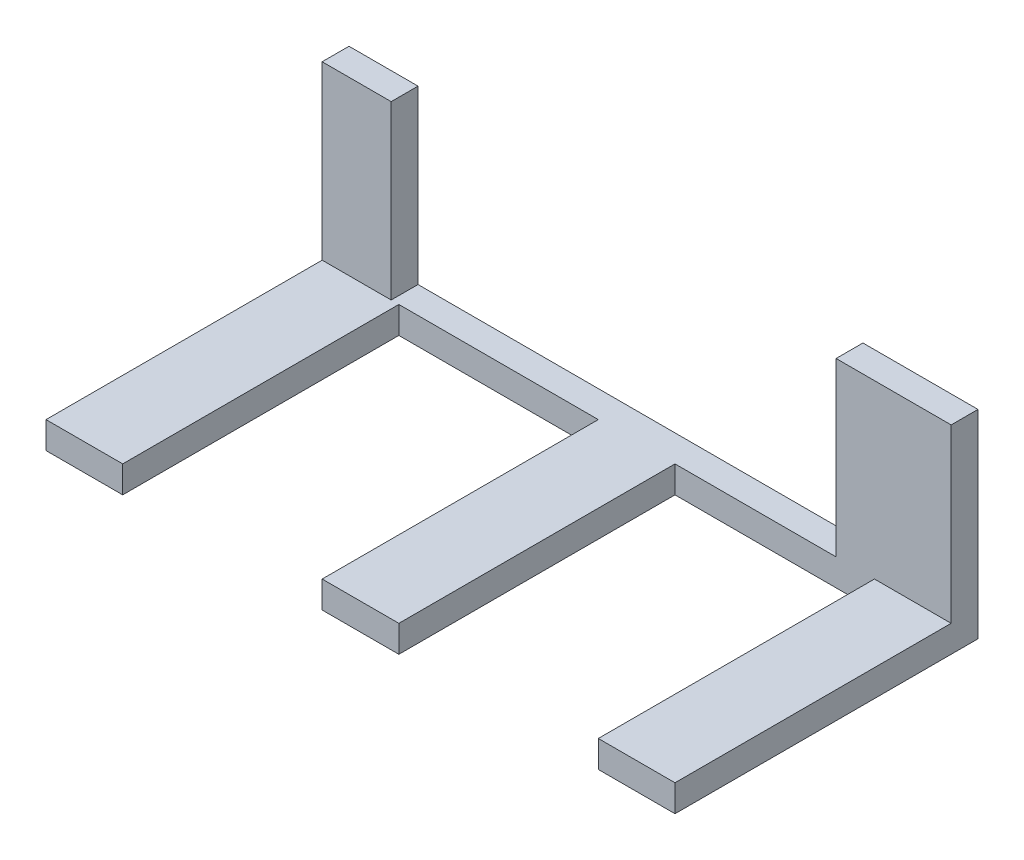
ISO-10303-21;
HEADER;
FILE_DESCRIPTION(('STEP AP214'),'2;1');
FILE_NAME('part.step','',(''),(''),'','','');
FILE_SCHEMA(('AUTOMOTIVE_DESIGN { 1 0 10303 214 1 1 1 1 }'));
ENDSEC;
DATA;
#1=APPLICATION_CONTEXT('core data for automotive mechanical design processes');
#2=APPLICATION_PROTOCOL_DEFINITION('international standard','automotive_design',2000,#1);
#3=PRODUCT_CONTEXT('',#1,'mechanical');
#4=PRODUCT('Part','Part','',(#3));
#5=PRODUCT_RELATED_PRODUCT_CATEGORY('part','',(#4));
#6=PRODUCT_DEFINITION_FORMATION('','',#4);
#7=PRODUCT_DEFINITION_CONTEXT('part definition',#1,'design');
#8=PRODUCT_DEFINITION('design','',#6,#7);
#9=PRODUCT_DEFINITION_SHAPE('','',#8);
#10=(LENGTH_UNIT() NAMED_UNIT(*) SI_UNIT(.MILLI.,.METRE.));
#11=(NAMED_UNIT(*) PLANE_ANGLE_UNIT() SI_UNIT($,.RADIAN.));
#12=(NAMED_UNIT(*) SI_UNIT($,.STERADIAN.) SOLID_ANGLE_UNIT());
#13=UNCERTAINTY_MEASURE_WITH_UNIT(LENGTH_MEASURE(1.E-05),#10,'distance_accuracy_value','');
#14=(GEOMETRIC_REPRESENTATION_CONTEXT(3) GLOBAL_UNCERTAINTY_ASSIGNED_CONTEXT((#13)) GLOBAL_UNIT_ASSIGNED_CONTEXT((#10,
#11,#12)) REPRESENTATION_CONTEXT('',''));
#15=CARTESIAN_POINT('',(0.,0.,0.));
#16=DIRECTION('',(0.,0.,1.));
#17=DIRECTION('',(1.,0.,0.));
#18=AXIS2_PLACEMENT_3D('',#15,#16,#17);
#19=CARTESIAN_POINT('',(0.,0.,3.5));
#20=DIRECTION('',(0.,0.,1.));
#21=DIRECTION('',(1.,0.,0.));
#22=AXIS2_PLACEMENT_3D('',#19,#20,#21);
#23=PLANE('',#22);
#24=DIRECTION('',(0.,-1.,0.));
#25=VECTOR('',#24,1.);
#26=CARTESIAN_POINT('',(13.2274700071922,0.,3.5));
#27=LINE('',#26,#25);
#28=CARTESIAN_POINT('',(13.2274700071922,-24.9519464720195,3.5));
#29=VERTEX_POINT('',#28);
#30=CARTESIAN_POINT('',(13.2274700071922,-28.4519464720195,3.5));
#31=VERTEX_POINT('',#30);
#32=EDGE_CURVE('E53',#29,#31,#27,.T.);
#33=ORIENTED_EDGE('',*,*,#32,.F.);
#34=DIRECTION('',(-1.,0.,0.));
#35=VECTOR('',#34,1.);
#36=CARTESIAN_POINT('',(0.,-24.9519464720195,3.5));
#37=LINE('',#36,#35);
#38=CARTESIAN_POINT('',(23.2274700071922,-24.9519464720195,3.5));
#39=VERTEX_POINT('',#38);
#40=EDGE_CURVE('E184',#39,#29,#37,.T.);
#41=ORIENTED_EDGE('',*,*,#40,.F.);
#42=DIRECTION('',(0.,1.,0.));
#43=VECTOR('',#42,1.);
#44=CARTESIAN_POINT('',(23.2274700071922,-28.4519464720195,3.5));
#45=LINE('',#44,#43);
#46=CARTESIAN_POINT('',(23.2274700071922,-2.55194647201947,3.5));
#47=VERTEX_POINT('',#46);
#48=EDGE_CURVE('E272',#39,#47,#45,.T.);
#49=ORIENTED_EDGE('',*,*,#48,.T.);
#50=DIRECTION('',(1.,0.,0.));
#51=VECTOR('',#50,1.);
#52=CARTESIAN_POINT('',(8.22747000719218,-2.55194647201947,3.5));
#53=LINE('',#52,#51);
#54=CARTESIAN_POINT('',(8.22747000719218,-2.55194647201947,3.5));
#55=VERTEX_POINT('',#54);
#56=EDGE_CURVE('E294',#55,#47,#53,.T.);
#57=ORIENTED_EDGE('',*,*,#56,.F.);
#58=DIRECTION('',(0.,-1.,0.));
#59=VECTOR('',#58,1.);
#60=CARTESIAN_POINT('',(8.22747000719218,-2.55194647201947,3.5));
#61=LINE('',#60,#59);
#62=CARTESIAN_POINT('',(8.22747000719218,-24.9519464720195,3.5));
#63=VERTEX_POINT('',#62);
#64=EDGE_CURVE('E290',#55,#63,#61,.T.);
#65=ORIENTED_EDGE('',*,*,#64,.T.);
#66=DIRECTION('',(-1.,0.,0.));
#67=VECTOR('',#66,1.);
#68=CARTESIAN_POINT('',(-58.7725299928078,-24.9519464720195,3.5));
#69=LINE('',#68,#67);
#70=CARTESIAN_POINT('',(-12.7725299928078,-24.9519464720195,3.5));
#71=VERTEX_POINT('',#70);
#72=EDGE_CURVE('E280',#63,#71,#69,.T.);
#73=ORIENTED_EDGE('',*,*,#72,.T.);
#74=DIRECTION('',(0.,-1.,0.));
#75=VECTOR('',#74,1.);
#76=CARTESIAN_POINT('',(-12.7725299928078,0.,3.5));
#77=LINE('',#76,#75);
#78=CARTESIAN_POINT('',(-12.7725299928078,-28.4519464720195,3.5));
#79=VERTEX_POINT('',#78);
#80=EDGE_CURVE('E188',#71,#79,#77,.T.);
#81=ORIENTED_EDGE('',*,*,#80,.T.);
#82=DIRECTION('',(1.,0.,0.));
#83=VECTOR('',#82,1.);
#84=CARTESIAN_POINT('',(-58.7725299928078,-28.4519464720195,3.5));
#85=LINE('',#84,#83);
#86=EDGE_CURVE('E58',#79,#31,#85,.T.);
#87=ORIENTED_EDGE('',*,*,#86,.T.);
#88=EDGE_LOOP('',(#33,#41,#49,#57,#65,#73,#81,#87));
#89=FACE_BOUND('',#88,.T.);
#90=ADVANCED_FACE('F35',(#89),#23,.T.);
#91=DIRECTION('',(0.,1.,0.));
#92=VECTOR('',#91,1.);
#93=CARTESIAN_POINT('',(-22.7725299928079,0.,3.5));
#94=LINE('',#93,#92);
#95=CARTESIAN_POINT('',(-22.7725299928078,-28.4519464720195,3.5));
#96=VERTEX_POINT('',#95);
#97=CARTESIAN_POINT('',(-22.7725299928078,-24.9519464720195,3.5));
#98=VERTEX_POINT('',#97);
#99=EDGE_CURVE('E185',#96,#98,#94,.T.);
#100=ORIENTED_EDGE('',*,*,#99,.T.);
#101=CARTESIAN_POINT('',(-48.7725299928078,-24.9519464720195,3.5));
#102=VERTEX_POINT('',#101);
#103=EDGE_CURVE('E39',#98,#102,#69,.T.);
#104=ORIENTED_EDGE('',*,*,#103,.T.);
#105=DIRECTION('',(0.,1.,0.));
#106=VECTOR('',#105,1.);
#107=CARTESIAN_POINT('',(-48.7725299928078,0.,3.5));
#108=LINE('',#107,#106);
#109=CARTESIAN_POINT('',(-48.7725299928078,-28.4519464720195,3.5));
#110=VERTEX_POINT('',#109);
#111=EDGE_CURVE('E217',#110,#102,#108,.T.);
#112=ORIENTED_EDGE('',*,*,#111,.F.);
#113=EDGE_CURVE('E235',#110,#96,#85,.T.);
#114=ORIENTED_EDGE('',*,*,#113,.T.);
#115=EDGE_LOOP('',(#100,#104,#112,#114));
#116=FACE_BOUND('',#115,.T.);
#117=ADVANCED_FACE('F371',(#116),#23,.T.);
#118=DIRECTION('',(-1.,0.,0.));
#119=VECTOR('',#118,1.);
#120=CARTESIAN_POINT('',(0.,-24.9519464720195,3.5));
#121=LINE('',#120,#119);
#122=CARTESIAN_POINT('',(-49.7725299928078,-24.9519464720195,3.5));
#123=VERTEX_POINT('',#122);
#124=CARTESIAN_POINT('',(-58.7725299928078,-24.9519464720195,3.5));
#125=VERTEX_POINT('',#124);
#126=EDGE_CURVE('E11',#123,#125,#121,.T.);
#127=ORIENTED_EDGE('',*,*,#126,.F.);
#128=DIRECTION('',(0.,-1.,0.));
#129=VECTOR('',#128,1.);
#130=CARTESIAN_POINT('',(-49.7725299928078,-2.55194647201947,3.5));
#131=LINE('',#130,#129);
#132=CARTESIAN_POINT('',(-49.7725299928078,-2.55194647201947,3.5));
#133=VERTEX_POINT('',#132);
#134=EDGE_CURVE('E260',#133,#123,#131,.T.);
#135=ORIENTED_EDGE('',*,*,#134,.F.);
#136=DIRECTION('',(1.,0.,0.));
#137=VECTOR('',#136,1.);
#138=CARTESIAN_POINT('',(-49.7725299928078,-2.55194647201947,3.5));
#139=LINE('',#138,#137);
#140=CARTESIAN_POINT('',(-58.7725299928078,-2.55194647201947,3.5));
#141=VERTEX_POINT('',#140);
#142=EDGE_CURVE('E310',#141,#133,#139,.T.);
#143=ORIENTED_EDGE('',*,*,#142,.F.);
#144=DIRECTION('',(0.,-1.,0.));
#145=VECTOR('',#144,1.);
#146=CARTESIAN_POINT('',(-58.7725299928078,-24.9519464720195,3.5));
#147=LINE('',#146,#145);
#148=EDGE_CURVE('E266',#141,#125,#147,.T.);
#149=ORIENTED_EDGE('',*,*,#148,.T.);
#150=EDGE_LOOP('',(#127,#135,#143,#149));
#151=FACE_BOUND('',#150,.T.);
#152=ADVANCED_FACE('F322',(#151),#23,.T.);
#153=CARTESIAN_POINT('',(-58.7725299928078,-24.9519464720195,3.5));
#154=DIRECTION('',(0.,-1.,0.));
#155=DIRECTION('',(0.,0.,-1.));
#156=AXIS2_PLACEMENT_3D('',#153,#154,#155);
#157=PLANE('',#156);
#158=DIRECTION('',(0.,0.,-1.));
#159=VECTOR('',#158,1.);
#160=CARTESIAN_POINT('',(-49.7725299928078,-24.9519464720195,0.));
#161=LINE('',#160,#159);
#162=CARTESIAN_POINT('',(-49.7725299928078,-24.9519464720195,0.));
#163=VERTEX_POINT('',#162);
#164=EDGE_CURVE('E252',#123,#163,#161,.T.);
#165=ORIENTED_EDGE('',*,*,#164,.F.);
#166=ORIENTED_EDGE('',*,*,#126,.T.);
#167=DIRECTION('',(0.,0.,-1.));
#168=VECTOR('',#167,1.);
#169=CARTESIAN_POINT('',(-58.7725299928078,-24.9519464720195,39.5));
#170=LINE('',#169,#168);
#171=CARTESIAN_POINT('',(-58.7725299928078,-24.9519464720195,39.5));
#172=VERTEX_POINT('',#171);
#173=EDGE_CURVE('E247',#172,#125,#170,.T.);
#174=ORIENTED_EDGE('',*,*,#173,.F.);
#175=DIRECTION('',(-1.,0.,0.));
#176=VECTOR('',#175,1.);
#177=CARTESIAN_POINT('',(0.,-24.9519464720195,39.5));
#178=LINE('',#177,#176);
#179=CARTESIAN_POINT('',(-48.7725299928078,-24.9519464720195,39.5));
#180=VERTEX_POINT('',#179);
#181=EDGE_CURVE('E218',#180,#172,#178,.T.);
#182=ORIENTED_EDGE('',*,*,#181,.F.);
#183=DIRECTION('',(0.,0.,-1.));
#184=VECTOR('',#183,1.);
#185=CARTESIAN_POINT('',(-48.7725299928078,-24.9519464720195,39.5));
#186=LINE('',#185,#184);
#187=EDGE_CURVE('E228',#180,#102,#186,.T.);
#188=ORIENTED_EDGE('',*,*,#187,.T.);
#189=ORIENTED_EDGE('',*,*,#103,.F.);
#190=DIRECTION('',(0.,0.,-1.));
#191=VECTOR('',#190,1.);
#192=CARTESIAN_POINT('',(-22.7725299928078,-24.9519464720195,39.5));
#193=LINE('',#192,#191);
#194=CARTESIAN_POINT('',(-22.7725299928078,-24.9519464720195,39.5));
#195=VERTEX_POINT('',#194);
#196=EDGE_CURVE('E203',#195,#98,#193,.T.);
#197=ORIENTED_EDGE('',*,*,#196,.F.);
#198=DIRECTION('',(-1.,0.,0.));
#199=VECTOR('',#198,1.);
#200=CARTESIAN_POINT('',(0.,-24.9519464720195,39.5));
#201=LINE('',#200,#199);
#202=CARTESIAN_POINT('',(-12.7725299928078,-24.9519464720195,39.5));
#203=VERTEX_POINT('',#202);
#204=EDGE_CURVE('E202',#203,#195,#201,.T.);
#205=ORIENTED_EDGE('',*,*,#204,.F.);
#206=DIRECTION('',(0.,0.,-1.));
#207=VECTOR('',#206,1.);
#208=CARTESIAN_POINT('',(-12.7725299928078,-24.9519464720195,39.5));
#209=LINE('',#208,#207);
#210=EDGE_CURVE('E208',#203,#71,#209,.T.);
#211=ORIENTED_EDGE('',*,*,#210,.T.);
#212=ORIENTED_EDGE('',*,*,#72,.F.);
#213=DIRECTION('',(0.,0.,1.));
#214=VECTOR('',#213,1.);
#215=CARTESIAN_POINT('',(8.22747000719218,-24.9519464720195,0.));
#216=LINE('',#215,#214);
#217=CARTESIAN_POINT('',(8.22747000719218,-24.9519464720195,0.));
#218=VERTEX_POINT('',#217);
#219=EDGE_CURVE('E263',#218,#63,#216,.T.);
#220=ORIENTED_EDGE('',*,*,#219,.F.);
#221=DIRECTION('',(-1.,0.,0.));
#222=VECTOR('',#221,1.);
#223=CARTESIAN_POINT('',(-58.7725299928078,-24.9519464720195,0.));
#224=LINE('',#223,#222);
#225=EDGE_CURVE('E284',#218,#163,#224,.T.);
#226=ORIENTED_EDGE('',*,*,#225,.T.);
#227=EDGE_LOOP('',(#165,#166,#174,#182,#188,#189,#197,#205,#211,#212,#220,#226));
#228=FACE_BOUND('',#227,.T.);
#229=ADVANCED_FACE('F349',(#228),#157,.F.);
#230=CARTESIAN_POINT('',(-58.7725299928078,-24.9519464720195,3.5));
#231=DIRECTION('',(1.,0.,0.));
#232=DIRECTION('',(0.,0.,-1.));
#233=AXIS2_PLACEMENT_3D('',#230,#231,#232);
#234=PLANE('',#233);
#235=DIRECTION('',(0.,-1.,0.));
#236=VECTOR('',#235,1.);
#237=CARTESIAN_POINT('',(-58.7725299928078,-24.9519464720195,0.));
#238=LINE('',#237,#236);
#239=CARTESIAN_POINT('',(-58.7725299928078,-2.55194647201947,0.));
#240=VERTEX_POINT('',#239);
#241=CARTESIAN_POINT('',(-58.7725299928078,-28.4519464720195,0.));
#242=VERTEX_POINT('',#241);
#243=EDGE_CURVE('E276',#240,#242,#238,.T.);
#244=ORIENTED_EDGE('',*,*,#243,.T.);
#245=DIRECTION('',(0.,0.,-1.));
#246=VECTOR('',#245,1.);
#247=CARTESIAN_POINT('',(-58.7725299928078,-28.4519464720195,3.5));
#248=LINE('',#247,#246);
#249=CARTESIAN_POINT('',(-58.7725299928078,-28.4519464720195,39.5));
#250=VERTEX_POINT('',#249);
#251=EDGE_CURVE('E45',#250,#242,#248,.T.);
#252=ORIENTED_EDGE('',*,*,#251,.F.);
#253=DIRECTION('',(0.,-1.,0.));
#254=VECTOR('',#253,1.);
#255=CARTESIAN_POINT('',(-58.7725299928078,0.,39.5));
#256=LINE('',#255,#254);
#257=EDGE_CURVE('E221',#172,#250,#256,.T.);
#258=ORIENTED_EDGE('',*,*,#257,.F.);
#259=ORIENTED_EDGE('',*,*,#173,.T.);
#260=ORIENTED_EDGE('',*,*,#148,.F.);
#261=DIRECTION('',(0.,0.,1.));
#262=VECTOR('',#261,1.);
#263=CARTESIAN_POINT('',(-58.7725299928078,-2.55194647201947,3.5));
#264=LINE('',#263,#262);
#265=EDGE_CURVE('E257',#240,#141,#264,.T.);
#266=ORIENTED_EDGE('',*,*,#265,.F.);
#267=EDGE_LOOP('',(#244,#252,#258,#259,#260,#266));
#268=FACE_BOUND('',#267,.T.);
#269=ADVANCED_FACE('F37',(#268),#234,.F.);
#270=CARTESIAN_POINT('',(-58.7725299928078,-28.4519464720195,3.5));
#271=DIRECTION('',(0.,1.,0.));
#272=DIRECTION('',(0.,0.,1.));
#273=AXIS2_PLACEMENT_3D('',#270,#271,#272);
#274=PLANE('',#273);
#275=DIRECTION('',(1.,0.,0.));
#276=VECTOR('',#275,1.);
#277=CARTESIAN_POINT('',(-58.7725299928078,-28.4519464720195,0.));
#278=LINE('',#277,#276);
#279=CARTESIAN_POINT('',(23.2274700071922,-28.4519464720195,0.));
#280=VERTEX_POINT('',#279);
#281=EDGE_CURVE('E332',#242,#280,#278,.T.);
#282=ORIENTED_EDGE('',*,*,#281,.T.);
#283=DIRECTION('',(0.,0.,-1.));
#284=VECTOR('',#283,1.);
#285=CARTESIAN_POINT('',(23.2274700071922,-28.4519464720195,3.5));
#286=LINE('',#285,#284);
#287=CARTESIAN_POINT('',(23.2274700071922,-28.4519464720195,39.5));
#288=VERTEX_POINT('',#287);
#289=EDGE_CURVE('E283',#288,#280,#286,.T.);
#290=ORIENTED_EDGE('',*,*,#289,.F.);
#291=DIRECTION('',(1.,0.,0.));
#292=VECTOR('',#291,1.);
#293=CARTESIAN_POINT('',(0.,-28.4519464720195,39.5));
#294=LINE('',#293,#292);
#295=CARTESIAN_POINT('',(13.2274700071922,-28.4519464720195,39.5));
#296=VERTEX_POINT('',#295);
#297=EDGE_CURVE('E172',#296,#288,#294,.T.);
#298=ORIENTED_EDGE('',*,*,#297,.F.);
#299=DIRECTION('',(0.,0.,-1.));
#300=VECTOR('',#299,1.);
#301=CARTESIAN_POINT('',(13.2274700071922,-28.4519464720195,39.5));
#302=LINE('',#301,#300);
#303=EDGE_CURVE('E168',#296,#31,#302,.T.);
#304=ORIENTED_EDGE('',*,*,#303,.T.);
#305=ORIENTED_EDGE('',*,*,#86,.F.);
#306=DIRECTION('',(0.,0.,-1.));
#307=VECTOR('',#306,1.);
#308=CARTESIAN_POINT('',(-12.7725299928078,-28.4519464720195,39.5));
#309=LINE('',#308,#307);
#310=CARTESIAN_POINT('',(-12.7725299928078,-28.4519464720195,39.5));
#311=VERTEX_POINT('',#310);
#312=EDGE_CURVE('E211',#311,#79,#309,.T.);
#313=ORIENTED_EDGE('',*,*,#312,.F.);
#314=DIRECTION('',(1.,0.,0.));
#315=VECTOR('',#314,1.);
#316=CARTESIAN_POINT('',(0.,-28.4519464720195,39.5));
#317=LINE('',#316,#315);
#318=CARTESIAN_POINT('',(-22.7725299928078,-28.4519464720195,39.5));
#319=VERTEX_POINT('',#318);
#320=EDGE_CURVE('E197',#319,#311,#317,.T.);
#321=ORIENTED_EDGE('',*,*,#320,.F.);
#322=DIRECTION('',(0.,0.,-1.));
#323=VECTOR('',#322,1.);
#324=CARTESIAN_POINT('',(-22.7725299928078,-28.4519464720195,39.5));
#325=LINE('',#324,#323);
#326=EDGE_CURVE('E214',#319,#96,#325,.T.);
#327=ORIENTED_EDGE('',*,*,#326,.T.);
#328=ORIENTED_EDGE('',*,*,#113,.F.);
#329=DIRECTION('',(0.,0.,-1.));
#330=VECTOR('',#329,1.);
#331=CARTESIAN_POINT('',(-48.7725299928078,-28.4519464720195,39.5));
#332=LINE('',#331,#330);
#333=CARTESIAN_POINT('',(-48.7725299928078,-28.4519464720195,39.5));
#334=VERTEX_POINT('',#333);
#335=EDGE_CURVE('E242',#334,#110,#332,.T.);
#336=ORIENTED_EDGE('',*,*,#335,.F.);
#337=DIRECTION('',(1.,0.,0.));
#338=VECTOR('',#337,1.);
#339=CARTESIAN_POINT('',(0.,-28.4519464720195,39.5));
#340=LINE('',#339,#338);
#341=EDGE_CURVE('E224',#250,#334,#340,.T.);
#342=ORIENTED_EDGE('',*,*,#341,.F.);
#343=ORIENTED_EDGE('',*,*,#251,.T.);
#344=EDGE_LOOP('',(#282,#290,#298,#304,#305,#313,#321,#327,#328,#336,#342,#343));
#345=FACE_BOUND('',#344,.T.);
#346=ADVANCED_FACE('F359',(#345),#274,.F.);
#347=CARTESIAN_POINT('',(23.2274700071922,-28.4519464720195,3.5));
#348=DIRECTION('',(-1.,0.,0.));
#349=DIRECTION('',(0.,0.,1.));
#350=AXIS2_PLACEMENT_3D('',#347,#348,#349);
#351=PLANE('',#350);
#352=DIRECTION('',(0.,1.,0.));
#353=VECTOR('',#352,1.);
#354=CARTESIAN_POINT('',(23.2274700071922,-28.4519464720195,0.));
#355=LINE('',#354,#353);
#356=CARTESIAN_POINT('',(23.2274700071922,-2.55194647201947,0.));
#357=VERTEX_POINT('',#356);
#358=EDGE_CURVE('E335',#280,#357,#355,.T.);
#359=ORIENTED_EDGE('',*,*,#358,.T.);
#360=DIRECTION('',(0.,0.,-1.));
#361=VECTOR('',#360,1.);
#362=CARTESIAN_POINT('',(23.2274700071922,-2.55194647201947,3.5));
#363=LINE('',#362,#361);
#364=EDGE_CURVE('E289',#47,#357,#363,.T.);
#365=ORIENTED_EDGE('',*,*,#364,.F.);
#366=ORIENTED_EDGE('',*,*,#48,.F.);
#367=DIRECTION('',(0.,0.,-1.));
#368=VECTOR('',#367,1.);
#369=CARTESIAN_POINT('',(23.2274700071922,-24.9519464720195,39.5));
#370=LINE('',#369,#368);
#371=CARTESIAN_POINT('',(23.2274700071922,-24.9519464720195,39.5));
#372=VERTEX_POINT('',#371);
#373=EDGE_CURVE('E190',#372,#39,#370,.T.);
#374=ORIENTED_EDGE('',*,*,#373,.F.);
#375=DIRECTION('',(0.,1.,0.));
#376=VECTOR('',#375,1.);
#377=CARTESIAN_POINT('',(23.2274700071922,0.,39.5));
#378=LINE('',#377,#376);
#379=EDGE_CURVE('E178',#288,#372,#378,.T.);
#380=ORIENTED_EDGE('',*,*,#379,.F.);
#381=ORIENTED_EDGE('',*,*,#289,.T.);
#382=EDGE_LOOP('',(#359,#365,#366,#374,#380,#381));
#383=FACE_BOUND('',#382,.T.);
#384=ADVANCED_FACE('F389',(#383),#351,.F.);
#385=CARTESIAN_POINT('',(0.,0.,0.));
#386=DIRECTION('',(0.,0.,1.));
#387=DIRECTION('',(1.,0.,0.));
#388=AXIS2_PLACEMENT_3D('',#385,#386,#387);
#389=PLANE('',#388);
#390=ORIENTED_EDGE('',*,*,#243,.F.);
#391=DIRECTION('',(-1.,0.,0.));
#392=VECTOR('',#391,1.);
#393=CARTESIAN_POINT('',(-58.7725299928078,-2.55194647201947,0.));
#394=LINE('',#393,#392);
#395=CARTESIAN_POINT('',(-49.7725299928078,-2.55194647201947,0.));
#396=VERTEX_POINT('',#395);
#397=EDGE_CURVE('E305',#396,#240,#394,.T.);
#398=ORIENTED_EDGE('',*,*,#397,.F.);
#399=DIRECTION('',(0.,-1.,0.));
#400=VECTOR('',#399,1.);
#401=CARTESIAN_POINT('',(-49.7725299928078,-2.55194647201947,0.));
#402=LINE('',#401,#400);
#403=EDGE_CURVE('E264',#396,#163,#402,.T.);
#404=ORIENTED_EDGE('',*,*,#403,.T.);
#405=ORIENTED_EDGE('',*,*,#225,.F.);
#406=DIRECTION('',(0.,-1.,0.));
#407=VECTOR('',#406,1.);
#408=CARTESIAN_POINT('',(8.22747000719218,-2.55194647201947,0.));
#409=LINE('',#408,#407);
#410=CARTESIAN_POINT('',(8.22747000719218,-2.55194647201947,0.));
#411=VERTEX_POINT('',#410);
#412=EDGE_CURVE('E334',#411,#218,#409,.T.);
#413=ORIENTED_EDGE('',*,*,#412,.F.);
#414=DIRECTION('',(-1.,0.,0.));
#415=VECTOR('',#414,1.);
#416=CARTESIAN_POINT('',(23.2274700071922,-2.55194647201947,0.));
#417=LINE('',#416,#415);
#418=EDGE_CURVE('E299',#357,#411,#417,.T.);
#419=ORIENTED_EDGE('',*,*,#418,.F.);
#420=ORIENTED_EDGE('',*,*,#358,.F.);
#421=ORIENTED_EDGE('',*,*,#281,.F.);
#422=EDGE_LOOP('',(#390,#398,#404,#405,#413,#419,#420,#421));
#423=FACE_BOUND('',#422,.T.);
#424=ADVANCED_FACE('F330',(#423),#389,.F.);
#425=CARTESIAN_POINT('',(8.22747000719218,-2.55194647201947,0.));
#426=DIRECTION('',(1.,0.,0.));
#427=DIRECTION('',(0.,0.,-1.));
#428=AXIS2_PLACEMENT_3D('',#425,#426,#427);
#429=PLANE('',#428);
#430=ORIENTED_EDGE('',*,*,#219,.T.);
#431=ORIENTED_EDGE('',*,*,#64,.F.);
#432=DIRECTION('',(0.,0.,1.));
#433=VECTOR('',#432,1.);
#434=CARTESIAN_POINT('',(8.22747000719218,-2.55194647201947,0.));
#435=LINE('',#434,#433);
#436=EDGE_CURVE('E297',#411,#55,#435,.T.);
#437=ORIENTED_EDGE('',*,*,#436,.F.);
#438=ORIENTED_EDGE('',*,*,#412,.T.);
#439=EDGE_LOOP('',(#430,#431,#437,#438));
#440=FACE_BOUND('',#439,.T.);
#441=ADVANCED_FACE('F347',(#440),#429,.F.);
#442=CARTESIAN_POINT('',(0.,-2.55194647201947,0.));
#443=DIRECTION('',(0.,1.,0.));
#444=DIRECTION('',(0.,0.,1.));
#445=AXIS2_PLACEMENT_3D('',#442,#443,#444);
#446=PLANE('',#445);
#447=ORIENTED_EDGE('',*,*,#364,.T.);
#448=ORIENTED_EDGE('',*,*,#418,.T.);
#449=ORIENTED_EDGE('',*,*,#436,.T.);
#450=ORIENTED_EDGE('',*,*,#56,.T.);
#451=EDGE_LOOP('',(#447,#448,#449,#450));
#452=FACE_BOUND('',#451,.T.);
#453=ADVANCED_FACE('F391',(#452),#446,.T.);
#454=CARTESIAN_POINT('',(-49.7725299928078,-2.55194647201947,0.));
#455=DIRECTION('',(-1.,0.,0.));
#456=DIRECTION('',(0.,0.,1.));
#457=AXIS2_PLACEMENT_3D('',#454,#455,#456);
#458=PLANE('',#457);
#459=ORIENTED_EDGE('',*,*,#164,.T.);
#460=ORIENTED_EDGE('',*,*,#403,.F.);
#461=DIRECTION('',(0.,0.,-1.));
#462=VECTOR('',#461,1.);
#463=CARTESIAN_POINT('',(-49.7725299928078,-2.55194647201947,0.));
#464=LINE('',#463,#462);
#465=EDGE_CURVE('E308',#133,#396,#464,.T.);
#466=ORIENTED_EDGE('',*,*,#465,.F.);
#467=ORIENTED_EDGE('',*,*,#134,.T.);
#468=EDGE_LOOP('',(#459,#460,#466,#467));
#469=FACE_BOUND('',#468,.T.);
#470=ADVANCED_FACE('F327',(#469),#458,.F.);
#471=CARTESIAN_POINT('',(0.,-2.55194647201947,0.));
#472=DIRECTION('',(0.,-1.,0.));
#473=DIRECTION('',(0.,0.,-1.));
#474=AXIS2_PLACEMENT_3D('',#471,#472,#473);
#475=PLANE('',#474);
#476=ORIENTED_EDGE('',*,*,#265,.T.);
#477=ORIENTED_EDGE('',*,*,#142,.T.);
#478=ORIENTED_EDGE('',*,*,#465,.T.);
#479=ORIENTED_EDGE('',*,*,#397,.T.);
#480=EDGE_LOOP('',(#476,#477,#478,#479));
#481=FACE_BOUND('',#480,.T.);
#482=ADVANCED_FACE('F314',(#481),#475,.F.);
#483=CARTESIAN_POINT('',(-48.7725299928078,0.,39.5));
#484=DIRECTION('',(-1.,0.,0.));
#485=DIRECTION('',(0.,0.,1.));
#486=AXIS2_PLACEMENT_3D('',#483,#484,#485);
#487=PLANE('',#486);
#488=ORIENTED_EDGE('',*,*,#111,.T.);
#489=ORIENTED_EDGE('',*,*,#187,.F.);
#490=DIRECTION('',(0.,1.,0.));
#491=VECTOR('',#490,1.);
#492=CARTESIAN_POINT('',(-48.7725299928078,0.,39.5));
#493=LINE('',#492,#491);
#494=EDGE_CURVE('E226',#334,#180,#493,.T.);
#495=ORIENTED_EDGE('',*,*,#494,.F.);
#496=ORIENTED_EDGE('',*,*,#335,.T.);
#497=EDGE_LOOP('',(#488,#489,#495,#496));
#498=FACE_BOUND('',#497,.T.);
#499=ADVANCED_FACE('F368',(#498),#487,.F.);
#500=CARTESIAN_POINT('',(0.,0.,39.5));
#501=DIRECTION('',(0.,0.,1.));
#502=DIRECTION('',(1.,0.,0.));
#503=AXIS2_PLACEMENT_3D('',#500,#501,#502);
#504=PLANE('',#503);
#505=ORIENTED_EDGE('',*,*,#181,.T.);
#506=ORIENTED_EDGE('',*,*,#257,.T.);
#507=ORIENTED_EDGE('',*,*,#341,.T.);
#508=ORIENTED_EDGE('',*,*,#494,.T.);
#509=EDGE_LOOP('',(#505,#506,#507,#508));
#510=FACE_BOUND('',#509,.T.);
#511=ADVANCED_FACE('F362',(#510),#504,.T.);
#512=CARTESIAN_POINT('',(-22.7725299928079,0.,39.5));
#513=DIRECTION('',(-1.,0.,0.));
#514=DIRECTION('',(0.,-1.,0.));
#515=AXIS2_PLACEMENT_3D('',#512,#513,#514);
#516=PLANE('',#515);
#517=ORIENTED_EDGE('',*,*,#99,.F.);
#518=ORIENTED_EDGE('',*,*,#326,.F.);
#519=DIRECTION('',(0.,1.,0.));
#520=VECTOR('',#519,1.);
#521=CARTESIAN_POINT('',(-22.7725299928079,0.,39.5));
#522=LINE('',#521,#520);
#523=EDGE_CURVE('E194',#319,#195,#522,.T.);
#524=ORIENTED_EDGE('',*,*,#523,.T.);
#525=ORIENTED_EDGE('',*,*,#196,.T.);
#526=EDGE_LOOP('',(#517,#518,#524,#525));
#527=FACE_BOUND('',#526,.T.);
#528=ADVANCED_FACE('F377',(#527),#516,.T.);
#529=CARTESIAN_POINT('',(-12.7725299928078,0.,39.5));
#530=DIRECTION('',(1.,0.,0.));
#531=DIRECTION('',(0.,1.,0.));
#532=AXIS2_PLACEMENT_3D('',#529,#530,#531);
#533=PLANE('',#532);
#534=ORIENTED_EDGE('',*,*,#80,.F.);
#535=ORIENTED_EDGE('',*,*,#210,.F.);
#536=DIRECTION('',(0.,-1.,0.));
#537=VECTOR('',#536,1.);
#538=CARTESIAN_POINT('',(-12.7725299928078,0.,39.5));
#539=LINE('',#538,#537);
#540=EDGE_CURVE('E199',#203,#311,#539,.T.);
#541=ORIENTED_EDGE('',*,*,#540,.T.);
#542=ORIENTED_EDGE('',*,*,#312,.T.);
#543=EDGE_LOOP('',(#534,#535,#541,#542));
#544=FACE_BOUND('',#543,.T.);
#545=ADVANCED_FACE('F384',(#544),#533,.T.);
#546=CARTESIAN_POINT('',(0.,0.,39.5));
#547=DIRECTION('',(0.,0.,1.));
#548=DIRECTION('',(1.,0.,0.));
#549=AXIS2_PLACEMENT_3D('',#546,#547,#548);
#550=PLANE('',#549);
#551=ORIENTED_EDGE('',*,*,#523,.F.);
#552=ORIENTED_EDGE('',*,*,#320,.T.);
#553=ORIENTED_EDGE('',*,*,#540,.F.);
#554=ORIENTED_EDGE('',*,*,#204,.T.);
#555=EDGE_LOOP('',(#551,#552,#553,#554));
#556=FACE_BOUND('',#555,.T.);
#557=ADVANCED_FACE('F382',(#556),#550,.T.);
#558=CARTESIAN_POINT('',(0.,-24.9519464720195,39.5));
#559=DIRECTION('',(0.,-1.,0.));
#560=DIRECTION('',(0.,0.,-1.));
#561=AXIS2_PLACEMENT_3D('',#558,#559,#560);
#562=PLANE('',#561);
#563=ORIENTED_EDGE('',*,*,#40,.T.);
#564=DIRECTION('',(0.,0.,-1.));
#565=VECTOR('',#564,1.);
#566=CARTESIAN_POINT('',(13.2274700071922,-24.9519464720195,39.5));
#567=LINE('',#566,#565);
#568=CARTESIAN_POINT('',(13.2274700071922,-24.9519464720195,39.5));
#569=VERTEX_POINT('',#568);
#570=EDGE_CURVE('E165',#569,#29,#567,.T.);
#571=ORIENTED_EDGE('',*,*,#570,.F.);
#572=DIRECTION('',(-1.,0.,0.));
#573=VECTOR('',#572,1.);
#574=CARTESIAN_POINT('',(0.,-24.9519464720195,39.5));
#575=LINE('',#574,#573);
#576=EDGE_CURVE('E173',#372,#569,#575,.T.);
#577=ORIENTED_EDGE('',*,*,#576,.F.);
#578=ORIENTED_EDGE('',*,*,#373,.T.);
#579=EDGE_LOOP('',(#563,#571,#577,#578));
#580=FACE_BOUND('',#579,.T.);
#581=ADVANCED_FACE('F183',(#580),#562,.F.);
#582=CARTESIAN_POINT('',(13.2274700071922,0.,39.5));
#583=DIRECTION('',(1.,0.,0.));
#584=DIRECTION('',(0.,1.,0.));
#585=AXIS2_PLACEMENT_3D('',#582,#583,#584);
#586=PLANE('',#585);
#587=ORIENTED_EDGE('',*,*,#32,.T.);
#588=ORIENTED_EDGE('',*,*,#303,.F.);
#589=DIRECTION('',(0.,-1.,0.));
#590=VECTOR('',#589,1.);
#591=CARTESIAN_POINT('',(13.2274700071922,0.,39.5));
#592=LINE('',#591,#590);
#593=EDGE_CURVE('E161',#569,#296,#592,.T.);
#594=ORIENTED_EDGE('',*,*,#593,.F.);
#595=ORIENTED_EDGE('',*,*,#570,.T.);
#596=EDGE_LOOP('',(#587,#588,#594,#595));
#597=FACE_BOUND('',#596,.T.);
#598=ADVANCED_FACE('F163',(#597),#586,.F.);
#599=CARTESIAN_POINT('',(0.,0.,39.5));
#600=DIRECTION('',(0.,0.,1.));
#601=DIRECTION('',(1.,0.,0.));
#602=AXIS2_PLACEMENT_3D('',#599,#600,#601);
#603=PLANE('',#602);
#604=ORIENTED_EDGE('',*,*,#576,.T.);
#605=ORIENTED_EDGE('',*,*,#593,.T.);
#606=ORIENTED_EDGE('',*,*,#297,.T.);
#607=ORIENTED_EDGE('',*,*,#379,.T.);
#608=EDGE_LOOP('',(#604,#605,#606,#607));
#609=FACE_BOUND('',#608,.T.);
#610=ADVANCED_FACE('F176',(#609),#603,.T.);
#611=CLOSED_SHELL('',(#90,#117,#152,#229,#269,#346,#384,#424,#441,#453,#470,#482,#499,#511,#528,
#545,#557,#581,#598,#610));
#612=MANIFOLD_SOLID_BREP('B2',#611);
#613=ADVANCED_BREP_SHAPE_REPRESENTATION('',(#18,#612),#14);
#614=SHAPE_DEFINITION_REPRESENTATION(#9,#613);
ENDSEC;
END-ISO-10303-21;
